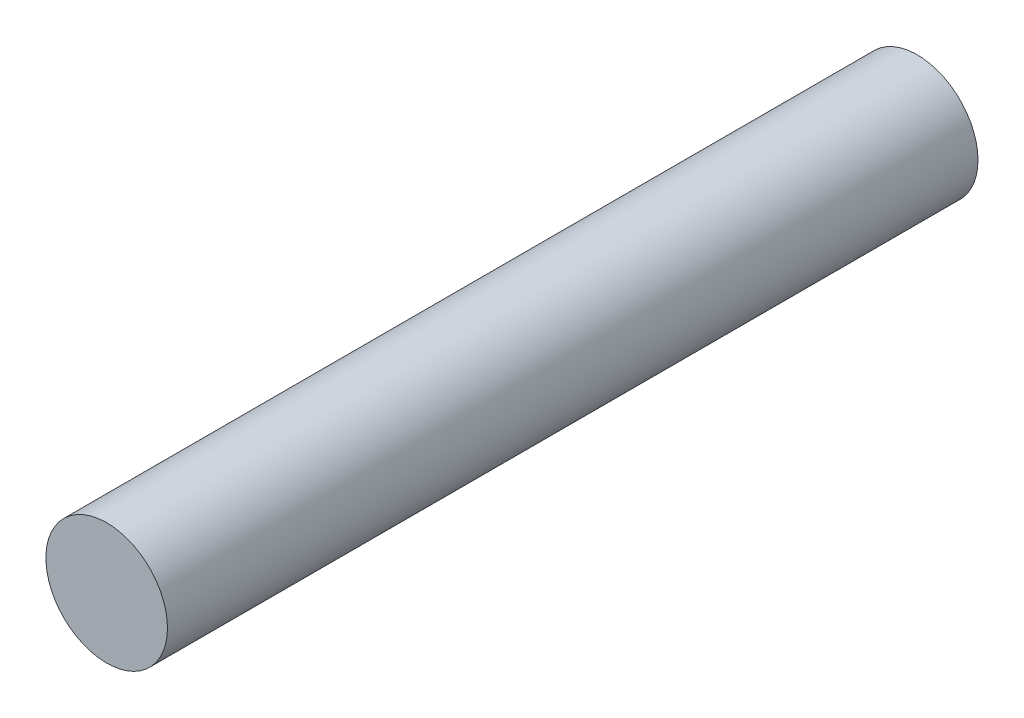
ISO-10303-21;
HEADER;
FILE_DESCRIPTION(('STEP AP214'),'2;1');
FILE_NAME('part.step','',(''),(''),'','','');
FILE_SCHEMA(('AUTOMOTIVE_DESIGN { 1 0 10303 214 1 1 1 1 }'));
ENDSEC;
DATA;
#1=APPLICATION_CONTEXT('core data for automotive mechanical design processes');
#2=APPLICATION_PROTOCOL_DEFINITION('international standard','automotive_design',2000,#1);
#3=PRODUCT_CONTEXT('',#1,'mechanical');
#4=PRODUCT('Part','Part','',(#3));
#5=PRODUCT_RELATED_PRODUCT_CATEGORY('part','',(#4));
#6=PRODUCT_DEFINITION_FORMATION('','',#4);
#7=PRODUCT_DEFINITION_CONTEXT('part definition',#1,'design');
#8=PRODUCT_DEFINITION('design','',#6,#7);
#9=PRODUCT_DEFINITION_SHAPE('','',#8);
#10=(LENGTH_UNIT() NAMED_UNIT(*) SI_UNIT(.MILLI.,.METRE.));
#11=(NAMED_UNIT(*) PLANE_ANGLE_UNIT() SI_UNIT($,.RADIAN.));
#12=(NAMED_UNIT(*) SI_UNIT($,.STERADIAN.) SOLID_ANGLE_UNIT());
#13=UNCERTAINTY_MEASURE_WITH_UNIT(LENGTH_MEASURE(1.E-05),#10,'distance_accuracy_value','');
#14=(GEOMETRIC_REPRESENTATION_CONTEXT(3) GLOBAL_UNCERTAINTY_ASSIGNED_CONTEXT((#13)) GLOBAL_UNIT_ASSIGNED_CONTEXT((#10,
#11,#12)) REPRESENTATION_CONTEXT('',''));
#15=CARTESIAN_POINT('',(0.,0.,0.));
#16=DIRECTION('',(0.,0.,1.));
#17=DIRECTION('',(1.,0.,0.));
#18=AXIS2_PLACEMENT_3D('',#15,#16,#17);
#19=CARTESIAN_POINT('',(0.,0.,10.));
#20=DIRECTION('',(0.,0.,-1.));
#21=DIRECTION('',(-1.,0.,0.));
#22=AXIS2_PLACEMENT_3D('',#19,#20,#21);
#23=CYLINDRICAL_SURFACE('',#22,1.5);
#24=CARTESIAN_POINT('',(0.,0.,10.));
#25=DIRECTION('',(0.,0.,1.));
#26=DIRECTION('',(1.,0.,0.));
#27=AXIS2_PLACEMENT_3D('',#24,#25,#26);
#28=CIRCLE('',#27,1.5);
#29=CARTESIAN_POINT('',(1.5,0.,10.));
#30=VERTEX_POINT('',#29);
#31=EDGE_CURVE('E10',#30,#30,#28,.T.);
#32=ORIENTED_EDGE('',*,*,#31,.F.);
#33=EDGE_LOOP('',(#32));
#34=FACE_BOUND('',#33,.T.);
#35=CARTESIAN_POINT('',(0.,0.,-10.));
#36=DIRECTION('',(0.,0.,1.));
#37=DIRECTION('',(1.,0.,0.));
#38=AXIS2_PLACEMENT_3D('',#35,#36,#37);
#39=CIRCLE('',#38,1.5);
#40=CARTESIAN_POINT('',(1.5,0.,-10.));
#41=VERTEX_POINT('',#40);
#42=EDGE_CURVE('E40',#41,#41,#39,.T.);
#43=ORIENTED_EDGE('',*,*,#42,.T.);
#44=EDGE_LOOP('',(#43));
#45=FACE_BOUND('',#44,.T.);
#46=ADVANCED_FACE('F37',(#34,#45),#23,.T.);
#47=CARTESIAN_POINT('',(0.,0.,10.));
#48=DIRECTION('',(0.,0.,1.));
#49=DIRECTION('',(1.,0.,0.));
#50=AXIS2_PLACEMENT_3D('',#47,#48,#49);
#51=PLANE('',#50);
#52=ORIENTED_EDGE('',*,*,#31,.T.);
#53=EDGE_LOOP('',(#52));
#54=FACE_BOUND('',#53,.T.);
#55=ADVANCED_FACE('F54',(#54),#51,.T.);
#56=CARTESIAN_POINT('',(0.,0.,-10.));
#57=DIRECTION('',(0.,0.,1.));
#58=DIRECTION('',(1.,0.,0.));
#59=AXIS2_PLACEMENT_3D('',#56,#57,#58);
#60=PLANE('',#59);
#61=ORIENTED_EDGE('',*,*,#42,.F.);
#62=EDGE_LOOP('',(#61));
#63=FACE_BOUND('',#62,.T.);
#64=ADVANCED_FACE('F52',(#63),#60,.F.);
#65=CLOSED_SHELL('',(#46,#55,#64));
#66=MANIFOLD_SOLID_BREP('B2',#65);
#67=ADVANCED_BREP_SHAPE_REPRESENTATION('',(#18,#66),#14);
#68=SHAPE_DEFINITION_REPRESENTATION(#9,#67);
ENDSEC;
END-ISO-10303-21;
